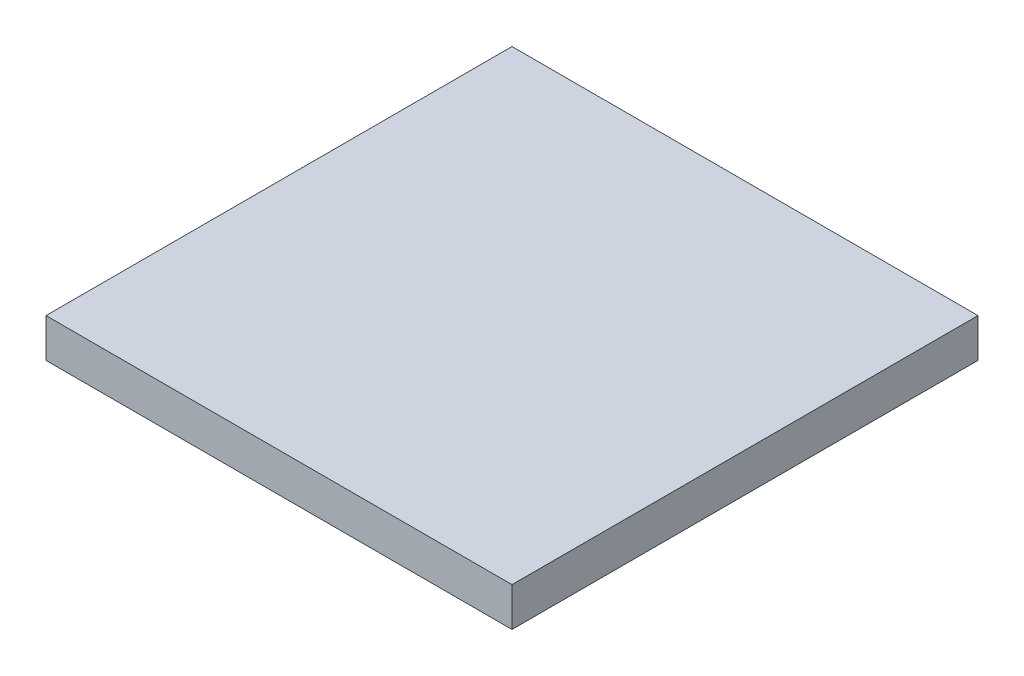
ISO-10303-21;
HEADER;
FILE_DESCRIPTION(('STEP AP214'),'2;1');
FILE_NAME('part.step','',(''),(''),'','','');
FILE_SCHEMA(('AUTOMOTIVE_DESIGN { 1 0 10303 214 1 1 1 1 }'));
ENDSEC;
DATA;
#1=APPLICATION_CONTEXT('core data for automotive mechanical design processes');
#2=APPLICATION_PROTOCOL_DEFINITION('international standard','automotive_design',2000,#1);
#3=PRODUCT_CONTEXT('',#1,'mechanical');
#4=PRODUCT('Part','Part','',(#3));
#5=PRODUCT_RELATED_PRODUCT_CATEGORY('part','',(#4));
#6=PRODUCT_DEFINITION_FORMATION('','',#4);
#7=PRODUCT_DEFINITION_CONTEXT('part definition',#1,'design');
#8=PRODUCT_DEFINITION('design','',#6,#7);
#9=PRODUCT_DEFINITION_SHAPE('','',#8);
#10=(LENGTH_UNIT() NAMED_UNIT(*) SI_UNIT(.MILLI.,.METRE.));
#11=(NAMED_UNIT(*) PLANE_ANGLE_UNIT() SI_UNIT($,.RADIAN.));
#12=(NAMED_UNIT(*) SI_UNIT($,.STERADIAN.) SOLID_ANGLE_UNIT());
#13=UNCERTAINTY_MEASURE_WITH_UNIT(LENGTH_MEASURE(1.E-05),#10,'distance_accuracy_value','');
#14=(GEOMETRIC_REPRESENTATION_CONTEXT(3) GLOBAL_UNCERTAINTY_ASSIGNED_CONTEXT((#13)) GLOBAL_UNIT_ASSIGNED_CONTEXT((#10,
#11,#12)) REPRESENTATION_CONTEXT('',''));
#15=CARTESIAN_POINT('',(0.,0.,0.));
#16=DIRECTION('',(0.,0.,1.));
#17=DIRECTION('',(1.,0.,0.));
#18=AXIS2_PLACEMENT_3D('',#15,#16,#17);
#19=CARTESIAN_POINT('',(0.6,0.1,-0.6));
#20=DIRECTION('',(-1.,0.,0.));
#21=DIRECTION('',(0.,0.,1.));
#22=AXIS2_PLACEMENT_3D('',#19,#20,#21);
#23=PLANE('',#22);
#24=DIRECTION('',(0.,0.,-1.));
#25=VECTOR('',#24,1.);
#26=CARTESIAN_POINT('',(0.6,0.,-0.6));
#27=LINE('',#26,#25);
#28=CARTESIAN_POINT('',(0.6,0.,0.6));
#29=VERTEX_POINT('',#28);
#30=CARTESIAN_POINT('',(0.6,0.,-0.6));
#31=VERTEX_POINT('',#30);
#32=EDGE_CURVE('E99',#29,#31,#27,.T.);
#33=ORIENTED_EDGE('',*,*,#32,.T.);
#34=DIRECTION('',(0.,-1.,0.));
#35=VECTOR('',#34,1.);
#36=CARTESIAN_POINT('',(0.6,0.1,-0.6));
#37=LINE('',#36,#35);
#38=CARTESIAN_POINT('',(0.6,0.1,-0.6));
#39=VERTEX_POINT('',#38);
#40=EDGE_CURVE('E11',#39,#31,#37,.T.);
#41=ORIENTED_EDGE('',*,*,#40,.F.);
#42=DIRECTION('',(0.,0.,-1.));
#43=VECTOR('',#42,1.);
#44=CARTESIAN_POINT('',(0.6,0.1,-0.6));
#45=LINE('',#44,#43);
#46=CARTESIAN_POINT('',(0.6,0.1,0.6));
#47=VERTEX_POINT('',#46);
#48=EDGE_CURVE('E87',#47,#39,#45,.T.);
#49=ORIENTED_EDGE('',*,*,#48,.F.);
#50=DIRECTION('',(0.,-1.,0.));
#51=VECTOR('',#50,1.);
#52=CARTESIAN_POINT('',(0.6,0.1,0.6));
#53=LINE('',#52,#51);
#54=EDGE_CURVE('E95',#47,#29,#53,.T.);
#55=ORIENTED_EDGE('',*,*,#54,.T.);
#56=EDGE_LOOP('',(#33,#41,#49,#55));
#57=FACE_BOUND('',#56,.T.);
#58=ADVANCED_FACE('F36',(#57),#23,.F.);
#59=CARTESIAN_POINT('',(-0.6,0.1,-0.6));
#60=DIRECTION('',(0.,0.,1.));
#61=DIRECTION('',(1.,0.,0.));
#62=AXIS2_PLACEMENT_3D('',#59,#60,#61);
#63=PLANE('',#62);
#64=DIRECTION('',(-1.,0.,0.));
#65=VECTOR('',#64,1.);
#66=CARTESIAN_POINT('',(-0.6,0.,-0.6));
#67=LINE('',#66,#65);
#68=CARTESIAN_POINT('',(-0.6,0.,-0.6));
#69=VERTEX_POINT('',#68);
#70=EDGE_CURVE('E91',#31,#69,#67,.T.);
#71=ORIENTED_EDGE('',*,*,#70,.T.);
#72=DIRECTION('',(0.,-1.,0.));
#73=VECTOR('',#72,1.);
#74=CARTESIAN_POINT('',(-0.6,0.1,-0.6));
#75=LINE('',#74,#73);
#76=CARTESIAN_POINT('',(-0.6,0.1,-0.6));
#77=VERTEX_POINT('',#76);
#78=EDGE_CURVE('E44',#77,#69,#75,.T.);
#79=ORIENTED_EDGE('',*,*,#78,.F.);
#80=DIRECTION('',(-1.,0.,0.));
#81=VECTOR('',#80,1.);
#82=CARTESIAN_POINT('',(-0.6,0.1,-0.6));
#83=LINE('',#82,#81);
#84=EDGE_CURVE('E82',#39,#77,#83,.T.);
#85=ORIENTED_EDGE('',*,*,#84,.F.);
#86=ORIENTED_EDGE('',*,*,#40,.T.);
#87=EDGE_LOOP('',(#71,#79,#85,#86));
#88=FACE_BOUND('',#87,.T.);
#89=ADVANCED_FACE('F90',(#88),#63,.F.);
#90=CARTESIAN_POINT('',(-0.6,0.1,-0.6));
#91=DIRECTION('',(1.,0.,0.));
#92=DIRECTION('',(0.,0.,-1.));
#93=AXIS2_PLACEMENT_3D('',#90,#91,#92);
#94=PLANE('',#93);
#95=DIRECTION('',(0.,0.,1.));
#96=VECTOR('',#95,1.);
#97=CARTESIAN_POINT('',(-0.6,0.,-0.6));
#98=LINE('',#97,#96);
#99=CARTESIAN_POINT('',(-0.6,0.,0.6));
#100=VERTEX_POINT('',#99);
#101=EDGE_CURVE('E69',#69,#100,#98,.T.);
#102=ORIENTED_EDGE('',*,*,#101,.T.);
#103=DIRECTION('',(0.,-1.,0.));
#104=VECTOR('',#103,1.);
#105=CARTESIAN_POINT('',(-0.6,0.1,0.6));
#106=LINE('',#105,#104);
#107=CARTESIAN_POINT('',(-0.6,0.1,0.6));
#108=VERTEX_POINT('',#107);
#109=EDGE_CURVE('E92',#108,#100,#106,.T.);
#110=ORIENTED_EDGE('',*,*,#109,.F.);
#111=DIRECTION('',(0.,0.,1.));
#112=VECTOR('',#111,1.);
#113=CARTESIAN_POINT('',(-0.6,0.1,-0.6));
#114=LINE('',#113,#112);
#115=EDGE_CURVE('E85',#77,#108,#114,.T.);
#116=ORIENTED_EDGE('',*,*,#115,.F.);
#117=ORIENTED_EDGE('',*,*,#78,.T.);
#118=EDGE_LOOP('',(#102,#110,#116,#117));
#119=FACE_BOUND('',#118,.T.);
#120=ADVANCED_FACE('F93',(#119),#94,.F.);
#121=CARTESIAN_POINT('',(-0.6,0.1,0.6));
#122=DIRECTION('',(0.,0.,-1.));
#123=DIRECTION('',(-1.,0.,0.));
#124=AXIS2_PLACEMENT_3D('',#121,#122,#123);
#125=PLANE('',#124);
#126=DIRECTION('',(1.,0.,0.));
#127=VECTOR('',#126,1.);
#128=CARTESIAN_POINT('',(-0.6,0.,0.6));
#129=LINE('',#128,#127);
#130=EDGE_CURVE('E75',#100,#29,#129,.T.);
#131=ORIENTED_EDGE('',*,*,#130,.T.);
#132=ORIENTED_EDGE('',*,*,#54,.F.);
#133=DIRECTION('',(1.,0.,0.));
#134=VECTOR('',#133,1.);
#135=CARTESIAN_POINT('',(-0.6,0.1,0.6));
#136=LINE('',#135,#134);
#137=EDGE_CURVE('E52',#108,#47,#136,.T.);
#138=ORIENTED_EDGE('',*,*,#137,.F.);
#139=ORIENTED_EDGE('',*,*,#109,.T.);
#140=EDGE_LOOP('',(#131,#132,#138,#139));
#141=FACE_BOUND('',#140,.T.);
#142=ADVANCED_FACE('F106',(#141),#125,.F.);
#143=CARTESIAN_POINT('',(0.,0.1,0.));
#144=DIRECTION('',(0.,1.,0.));
#145=DIRECTION('',(0.,0.,1.));
#146=AXIS2_PLACEMENT_3D('',#143,#144,#145);
#147=PLANE('',#146);
#148=ORIENTED_EDGE('',*,*,#48,.T.);
#149=ORIENTED_EDGE('',*,*,#84,.T.);
#150=ORIENTED_EDGE('',*,*,#115,.T.);
#151=ORIENTED_EDGE('',*,*,#137,.T.);
#152=EDGE_LOOP('',(#148,#149,#150,#151));
#153=FACE_BOUND('',#152,.T.);
#154=ADVANCED_FACE('F83',(#153),#147,.T.);
#155=CARTESIAN_POINT('',(0.,0.,0.));
#156=DIRECTION('',(0.,1.,0.));
#157=DIRECTION('',(0.,0.,1.));
#158=AXIS2_PLACEMENT_3D('',#155,#156,#157);
#159=PLANE('',#158);
#160=ORIENTED_EDGE('',*,*,#32,.F.);
#161=ORIENTED_EDGE('',*,*,#130,.F.);
#162=ORIENTED_EDGE('',*,*,#101,.F.);
#163=ORIENTED_EDGE('',*,*,#70,.F.);
#164=EDGE_LOOP('',(#160,#161,#162,#163));
#165=FACE_BOUND('',#164,.T.);
#166=ADVANCED_FACE('F109',(#165),#159,.F.);
#167=CLOSED_SHELL('',(#58,#89,#120,#142,#154,#166));
#168=MANIFOLD_SOLID_BREP('B2',#167);
#169=ADVANCED_BREP_SHAPE_REPRESENTATION('',(#18,#168),#14);
#170=SHAPE_DEFINITION_REPRESENTATION(#9,#169);
ENDSEC;
END-ISO-10303-21;
